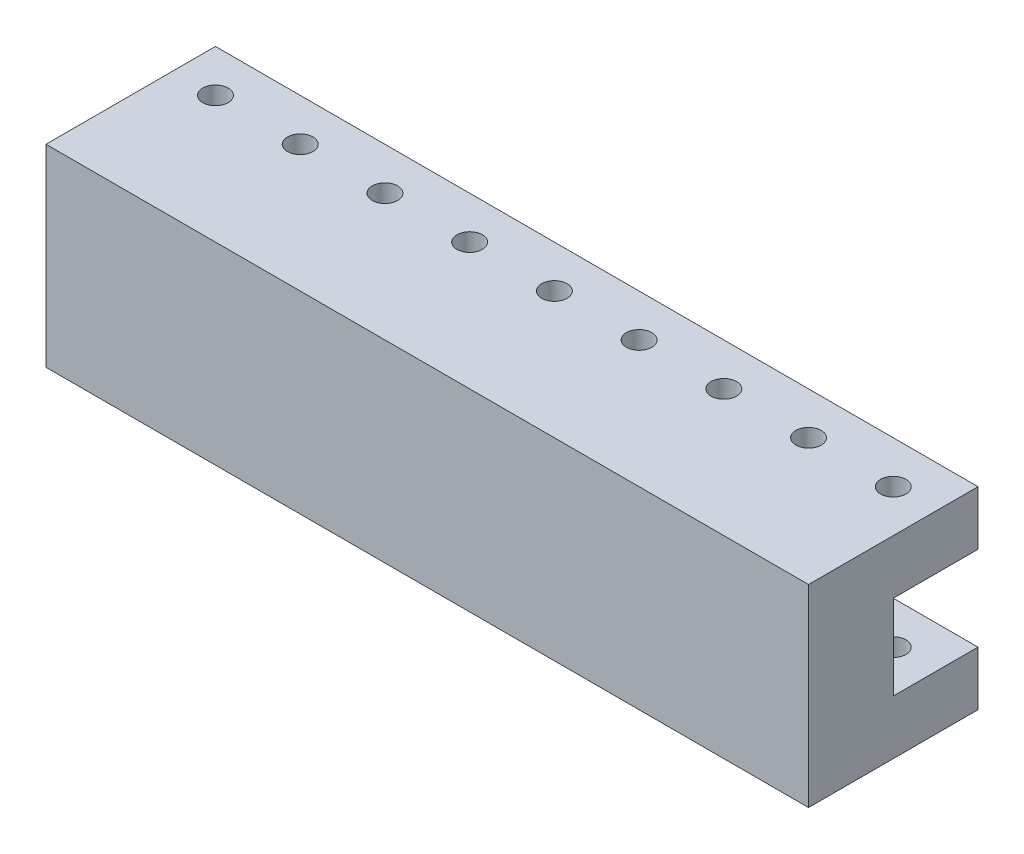
ISO-10303-21;
HEADER;
FILE_DESCRIPTION(('STEP AP214'),'2;1');
FILE_NAME('part.step','',(''),(''),'','','');
FILE_SCHEMA(('AUTOMOTIVE_DESIGN { 1 0 10303 214 1 1 1 1 }'));
ENDSEC;
DATA;
#1=APPLICATION_CONTEXT('core data for automotive mechanical design processes');
#2=APPLICATION_PROTOCOL_DEFINITION('international standard','automotive_design',2000,#1);
#3=PRODUCT_CONTEXT('',#1,'mechanical');
#4=PRODUCT('Part','Part','',(#3));
#5=PRODUCT_RELATED_PRODUCT_CATEGORY('part','',(#4));
#6=PRODUCT_DEFINITION_FORMATION('','',#4);
#7=PRODUCT_DEFINITION_CONTEXT('part definition',#1,'design');
#8=PRODUCT_DEFINITION('design','',#6,#7);
#9=PRODUCT_DEFINITION_SHAPE('','',#8);
#10=(LENGTH_UNIT() NAMED_UNIT(*) SI_UNIT(.MILLI.,.METRE.));
#11=(NAMED_UNIT(*) PLANE_ANGLE_UNIT() SI_UNIT($,.RADIAN.));
#12=(NAMED_UNIT(*) SI_UNIT($,.STERADIAN.) SOLID_ANGLE_UNIT());
#13=UNCERTAINTY_MEASURE_WITH_UNIT(LENGTH_MEASURE(1.E-05),#10,'distance_accuracy_value','');
#14=(GEOMETRIC_REPRESENTATION_CONTEXT(3) GLOBAL_UNCERTAINTY_ASSIGNED_CONTEXT((#13)) GLOBAL_UNIT_ASSIGNED_CONTEXT((#10,
#11,#12)) REPRESENTATION_CONTEXT('',''));
#15=CARTESIAN_POINT('',(0.,0.,0.));
#16=DIRECTION('',(0.,0.,1.));
#17=DIRECTION('',(1.,0.,0.));
#18=AXIS2_PLACEMENT_3D('',#15,#16,#17);
#19=CARTESIAN_POINT('',(0.,0.,5.));
#20=DIRECTION('',(0.,0.,-1.));
#21=DIRECTION('',(-1.,0.,0.));
#22=AXIS2_PLACEMENT_3D('',#19,#20,#21);
#23=PLANE('',#22);
#24=DIRECTION('',(0.,1.,0.));
#25=VECTOR('',#24,1.);
#26=CARTESIAN_POINT('',(45.,0.,5.));
#27=LINE('',#26,#25);
#28=CARTESIAN_POINT('',(45.,6.4,4.99999999999999));
#29=VERTEX_POINT('',#28);
#30=CARTESIAN_POINT('',(45.,16.4,5.));
#31=VERTEX_POINT('',#30);
#32=EDGE_CURVE('E169',#29,#31,#27,.T.);
#33=ORIENTED_EDGE('',*,*,#32,.F.);
#34=DIRECTION('',(1.,0.,0.));
#35=VECTOR('',#34,1.);
#36=CARTESIAN_POINT('',(-45.,6.4,4.99999999999999));
#37=LINE('',#36,#35);
#38=CARTESIAN_POINT('',(-45.,6.4,5.));
#39=VERTEX_POINT('',#38);
#40=EDGE_CURVE('E118',#39,#29,#37,.T.);
#41=ORIENTED_EDGE('',*,*,#40,.F.);
#42=DIRECTION('',(0.,-1.,0.));
#43=VECTOR('',#42,1.);
#44=CARTESIAN_POINT('',(-45.,0.,5.));
#45=LINE('',#44,#43);
#46=CARTESIAN_POINT('',(-45.,16.4,4.99999999999999));
#47=VERTEX_POINT('',#46);
#48=EDGE_CURVE('E129',#47,#39,#45,.T.);
#49=ORIENTED_EDGE('',*,*,#48,.F.);
#50=DIRECTION('',(1.,0.,0.));
#51=VECTOR('',#50,1.);
#52=CARTESIAN_POINT('',(-45.,16.4,4.99999999999999));
#53=LINE('',#52,#51);
#54=EDGE_CURVE('E71',#47,#31,#53,.T.);
#55=ORIENTED_EDGE('',*,*,#54,.T.);
#56=EDGE_LOOP('',(#33,#41,#49,#55));
#57=FACE_BOUND('',#56,.T.);
#58=ADVANCED_FACE('F37',(#57),#23,.T.);
#59=CARTESIAN_POINT('',(40.,0.,0.));
#60=DIRECTION('',(0.,1.,0.));
#61=DIRECTION('',(0.,0.,1.));
#62=AXIS2_PLACEMENT_3D('',#59,#60,#61);
#63=CYLINDRICAL_SURFACE('',#62,1.5);
#64=CARTESIAN_POINT('',(40.,16.4,0.));
#65=DIRECTION('',(0.,1.,0.));
#66=DIRECTION('',(0.,0.,1.));
#67=AXIS2_PLACEMENT_3D('',#64,#65,#66);
#68=CIRCLE('',#67,1.5);
#69=CARTESIAN_POINT('',(40.,16.4,1.49999999999999));
#70=VERTEX_POINT('',#69);
#71=EDGE_CURVE('E183',#70,#70,#68,.F.);
#72=ORIENTED_EDGE('',*,*,#71,.T.);
#73=EDGE_LOOP('',(#72));
#74=FACE_BOUND('',#73,.T.);
#75=CARTESIAN_POINT('',(40.,22.8,0.));
#76=DIRECTION('',(0.,1.,0.));
#77=DIRECTION('',(0.,0.,1.));
#78=AXIS2_PLACEMENT_3D('',#75,#76,#77);
#79=CIRCLE('',#78,1.5);
#80=CARTESIAN_POINT('',(40.,22.8,1.49999999999999));
#81=VERTEX_POINT('',#80);
#82=EDGE_CURVE('E189',#81,#81,#79,.T.);
#83=ORIENTED_EDGE('',*,*,#82,.T.);
#84=EDGE_LOOP('',(#83));
#85=FACE_BOUND('',#84,.T.);
#86=ADVANCED_FACE('F305',(#74,#85),#63,.F.);
#87=CARTESIAN_POINT('',(30.,0.,0.));
#88=DIRECTION('',(0.,1.,0.));
#89=DIRECTION('',(0.,0.,1.));
#90=AXIS2_PLACEMENT_3D('',#87,#88,#89);
#91=CYLINDRICAL_SURFACE('',#90,1.5);
#92=CARTESIAN_POINT('',(30.,16.4,0.));
#93=DIRECTION('',(0.,1.,0.));
#94=DIRECTION('',(0.,0.,1.));
#95=AXIS2_PLACEMENT_3D('',#92,#93,#94);
#96=CIRCLE('',#95,1.5);
#97=CARTESIAN_POINT('',(30.,16.4,1.5));
#98=VERTEX_POINT('',#97);
#99=EDGE_CURVE('E192',#98,#98,#96,.F.);
#100=ORIENTED_EDGE('',*,*,#99,.T.);
#101=EDGE_LOOP('',(#100));
#102=FACE_BOUND('',#101,.T.);
#103=CARTESIAN_POINT('',(30.,22.8,0.));
#104=DIRECTION('',(0.,1.,0.));
#105=DIRECTION('',(0.,0.,1.));
#106=AXIS2_PLACEMENT_3D('',#103,#104,#105);
#107=CIRCLE('',#106,1.5);
#108=CARTESIAN_POINT('',(30.,22.8,1.5));
#109=VERTEX_POINT('',#108);
#110=EDGE_CURVE('E193',#109,#109,#107,.T.);
#111=ORIENTED_EDGE('',*,*,#110,.T.);
#112=EDGE_LOOP('',(#111));
#113=FACE_BOUND('',#112,.T.);
#114=ADVANCED_FACE('F310',(#102,#113),#91,.F.);
#115=CARTESIAN_POINT('',(20.,0.,0.));
#116=DIRECTION('',(0.,1.,0.));
#117=DIRECTION('',(0.,0.,1.));
#118=AXIS2_PLACEMENT_3D('',#115,#116,#117);
#119=CYLINDRICAL_SURFACE('',#118,1.5);
#120=CARTESIAN_POINT('',(20.,16.4,0.));
#121=DIRECTION('',(0.,1.,0.));
#122=DIRECTION('',(0.,0.,1.));
#123=AXIS2_PLACEMENT_3D('',#120,#121,#122);
#124=CIRCLE('',#123,1.5);
#125=CARTESIAN_POINT('',(20.,16.4,1.5));
#126=VERTEX_POINT('',#125);
#127=EDGE_CURVE('E196',#126,#126,#124,.F.);
#128=ORIENTED_EDGE('',*,*,#127,.T.);
#129=EDGE_LOOP('',(#128));
#130=FACE_BOUND('',#129,.T.);
#131=CARTESIAN_POINT('',(20.,22.8,0.));
#132=DIRECTION('',(0.,1.,0.));
#133=DIRECTION('',(0.,0.,1.));
#134=AXIS2_PLACEMENT_3D('',#131,#132,#133);
#135=CIRCLE('',#134,1.5);
#136=CARTESIAN_POINT('',(20.,22.8,1.5));
#137=VERTEX_POINT('',#136);
#138=EDGE_CURVE('E197',#137,#137,#135,.T.);
#139=ORIENTED_EDGE('',*,*,#138,.T.);
#140=EDGE_LOOP('',(#139));
#141=FACE_BOUND('',#140,.T.);
#142=ADVANCED_FACE('F329',(#130,#141),#119,.F.);
#143=CARTESIAN_POINT('',(10.,0.,0.));
#144=DIRECTION('',(0.,1.,0.));
#145=DIRECTION('',(0.,0.,1.));
#146=AXIS2_PLACEMENT_3D('',#143,#144,#145);
#147=CYLINDRICAL_SURFACE('',#146,1.5);
#148=CARTESIAN_POINT('',(10.,16.4,0.));
#149=DIRECTION('',(0.,1.,0.));
#150=DIRECTION('',(0.,0.,1.));
#151=AXIS2_PLACEMENT_3D('',#148,#149,#150);
#152=CIRCLE('',#151,1.5);
#153=CARTESIAN_POINT('',(10.,16.4,1.5));
#154=VERTEX_POINT('',#153);
#155=EDGE_CURVE('E200',#154,#154,#152,.F.);
#156=ORIENTED_EDGE('',*,*,#155,.T.);
#157=EDGE_LOOP('',(#156));
#158=FACE_BOUND('',#157,.T.);
#159=CARTESIAN_POINT('',(10.,22.8,0.));
#160=DIRECTION('',(0.,1.,0.));
#161=DIRECTION('',(0.,0.,1.));
#162=AXIS2_PLACEMENT_3D('',#159,#160,#161);
#163=CIRCLE('',#162,1.5);
#164=CARTESIAN_POINT('',(10.,22.8,1.5));
#165=VERTEX_POINT('',#164);
#166=EDGE_CURVE('E201',#165,#165,#163,.T.);
#167=ORIENTED_EDGE('',*,*,#166,.T.);
#168=EDGE_LOOP('',(#167));
#169=FACE_BOUND('',#168,.T.);
#170=ADVANCED_FACE('F333',(#158,#169),#147,.F.);
#171=CARTESIAN_POINT('',(0.,0.,0.));
#172=DIRECTION('',(0.,1.,0.));
#173=DIRECTION('',(0.,0.,1.));
#174=AXIS2_PLACEMENT_3D('',#171,#172,#173);
#175=CYLINDRICAL_SURFACE('',#174,1.5);
#176=CARTESIAN_POINT('',(0.,16.4,0.));
#177=DIRECTION('',(0.,1.,0.));
#178=DIRECTION('',(0.,0.,1.));
#179=AXIS2_PLACEMENT_3D('',#176,#177,#178);
#180=CIRCLE('',#179,1.5);
#181=CARTESIAN_POINT('',(0.,16.4,1.5));
#182=VERTEX_POINT('',#181);
#183=EDGE_CURVE('E204',#182,#182,#180,.F.);
#184=ORIENTED_EDGE('',*,*,#183,.T.);
#185=EDGE_LOOP('',(#184));
#186=FACE_BOUND('',#185,.T.);
#187=CARTESIAN_POINT('',(0.,22.8,0.));
#188=DIRECTION('',(0.,1.,0.));
#189=DIRECTION('',(0.,0.,1.));
#190=AXIS2_PLACEMENT_3D('',#187,#188,#189);
#191=CIRCLE('',#190,1.5);
#192=CARTESIAN_POINT('',(0.,22.8,1.5));
#193=VERTEX_POINT('',#192);
#194=EDGE_CURVE('E205',#193,#193,#191,.T.);
#195=ORIENTED_EDGE('',*,*,#194,.T.);
#196=EDGE_LOOP('',(#195));
#197=FACE_BOUND('',#196,.T.);
#198=ADVANCED_FACE('F337',(#186,#197),#175,.F.);
#199=CARTESIAN_POINT('',(-10.,0.,0.));
#200=DIRECTION('',(0.,1.,0.));
#201=DIRECTION('',(0.,0.,1.));
#202=AXIS2_PLACEMENT_3D('',#199,#200,#201);
#203=CYLINDRICAL_SURFACE('',#202,1.5);
#204=CARTESIAN_POINT('',(-10.,16.4,0.));
#205=DIRECTION('',(0.,1.,0.));
#206=DIRECTION('',(0.,0.,1.));
#207=AXIS2_PLACEMENT_3D('',#204,#205,#206);
#208=CIRCLE('',#207,1.5);
#209=CARTESIAN_POINT('',(-10.,16.4,1.5));
#210=VERTEX_POINT('',#209);
#211=EDGE_CURVE('E208',#210,#210,#208,.F.);
#212=ORIENTED_EDGE('',*,*,#211,.T.);
#213=EDGE_LOOP('',(#212));
#214=FACE_BOUND('',#213,.T.);
#215=CARTESIAN_POINT('',(-10.,22.8,0.));
#216=DIRECTION('',(0.,1.,0.));
#217=DIRECTION('',(0.,0.,1.));
#218=AXIS2_PLACEMENT_3D('',#215,#216,#217);
#219=CIRCLE('',#218,1.5);
#220=CARTESIAN_POINT('',(-10.,22.8,1.5));
#221=VERTEX_POINT('',#220);
#222=EDGE_CURVE('E209',#221,#221,#219,.T.);
#223=ORIENTED_EDGE('',*,*,#222,.T.);
#224=EDGE_LOOP('',(#223));
#225=FACE_BOUND('',#224,.T.);
#226=ADVANCED_FACE('F341',(#214,#225),#203,.F.);
#227=CARTESIAN_POINT('',(-20.,0.,0.));
#228=DIRECTION('',(0.,1.,0.));
#229=DIRECTION('',(0.,0.,1.));
#230=AXIS2_PLACEMENT_3D('',#227,#228,#229);
#231=CYLINDRICAL_SURFACE('',#230,1.5);
#232=CARTESIAN_POINT('',(-20.,16.4,0.));
#233=DIRECTION('',(0.,1.,0.));
#234=DIRECTION('',(0.,0.,1.));
#235=AXIS2_PLACEMENT_3D('',#232,#233,#234);
#236=CIRCLE('',#235,1.5);
#237=CARTESIAN_POINT('',(-20.,16.4,1.5));
#238=VERTEX_POINT('',#237);
#239=EDGE_CURVE('E212',#238,#238,#236,.F.);
#240=ORIENTED_EDGE('',*,*,#239,.T.);
#241=EDGE_LOOP('',(#240));
#242=FACE_BOUND('',#241,.T.);
#243=CARTESIAN_POINT('',(-20.,22.8,0.));
#244=DIRECTION('',(0.,1.,0.));
#245=DIRECTION('',(0.,0.,1.));
#246=AXIS2_PLACEMENT_3D('',#243,#244,#245);
#247=CIRCLE('',#246,1.5);
#248=CARTESIAN_POINT('',(-20.,22.8,1.5));
#249=VERTEX_POINT('',#248);
#250=EDGE_CURVE('E213',#249,#249,#247,.T.);
#251=ORIENTED_EDGE('',*,*,#250,.T.);
#252=EDGE_LOOP('',(#251));
#253=FACE_BOUND('',#252,.T.);
#254=ADVANCED_FACE('F345',(#242,#253),#231,.F.);
#255=CARTESIAN_POINT('',(-45.,22.8,5.));
#256=DIRECTION('',(1.,0.,0.));
#257=DIRECTION('',(0.,0.,-1.));
#258=AXIS2_PLACEMENT_3D('',#255,#256,#257);
#259=PLANE('',#258);
#260=DIRECTION('',(0.,-1.,0.));
#261=VECTOR('',#260,1.);
#262=CARTESIAN_POINT('',(-45.,22.8,-5.));
#263=LINE('',#262,#261);
#264=CARTESIAN_POINT('',(-45.,22.8,-5.));
#265=VERTEX_POINT('',#264);
#266=CARTESIAN_POINT('',(-45.,16.4,-5.));
#267=VERTEX_POINT('',#266);
#268=EDGE_CURVE('E41',#265,#267,#263,.T.);
#269=ORIENTED_EDGE('',*,*,#268,.T.);
#270=DIRECTION('',(0.,0.,1.));
#271=VECTOR('',#270,1.);
#272=CARTESIAN_POINT('',(-45.,16.4,4.99999999999999));
#273=LINE('',#272,#271);
#274=EDGE_CURVE('E244',#267,#47,#273,.T.);
#275=ORIENTED_EDGE('',*,*,#274,.T.);
#276=ORIENTED_EDGE('',*,*,#48,.T.);
#277=DIRECTION('',(0.,0.,-1.));
#278=VECTOR('',#277,1.);
#279=CARTESIAN_POINT('',(-45.,6.4,4.99999999999999));
#280=LINE('',#279,#278);
#281=CARTESIAN_POINT('',(-45.,6.4,-5.00000000000012));
#282=VERTEX_POINT('',#281);
#283=EDGE_CURVE('E54',#39,#282,#280,.T.);
#284=ORIENTED_EDGE('',*,*,#283,.T.);
#285=DIRECTION('',(0.,-1.,0.));
#286=VECTOR('',#285,1.);
#287=CARTESIAN_POINT('',(-45.,22.8,-5.));
#288=LINE('',#287,#286);
#289=CARTESIAN_POINT('',(-45.,0.,-5.));
#290=VERTEX_POINT('',#289);
#291=EDGE_CURVE('E126',#282,#290,#288,.T.);
#292=ORIENTED_EDGE('',*,*,#291,.T.);
#293=DIRECTION('',(0.,0.,-1.));
#294=VECTOR('',#293,1.);
#295=CARTESIAN_POINT('',(-45.,0.,15.));
#296=LINE('',#295,#294);
#297=CARTESIAN_POINT('',(-45.,0.,15.));
#298=VERTEX_POINT('',#297);
#299=EDGE_CURVE('E181',#298,#290,#296,.T.);
#300=ORIENTED_EDGE('',*,*,#299,.F.);
#301=DIRECTION('',(0.,-1.,0.));
#302=VECTOR('',#301,1.);
#303=CARTESIAN_POINT('',(-45.,0.,15.));
#304=LINE('',#303,#302);
#305=CARTESIAN_POINT('',(-45.,22.8,15.));
#306=VERTEX_POINT('',#305);
#307=EDGE_CURVE('E165',#306,#298,#304,.T.);
#308=ORIENTED_EDGE('',*,*,#307,.F.);
#309=DIRECTION('',(0.,0.,1.));
#310=VECTOR('',#309,1.);
#311=CARTESIAN_POINT('',(-45.,22.8,5.));
#312=LINE('',#311,#310);
#313=EDGE_CURVE('E219',#265,#306,#312,.T.);
#314=ORIENTED_EDGE('',*,*,#313,.F.);
#315=EDGE_LOOP('',(#269,#275,#276,#284,#292,#300,#308,#314));
#316=FACE_BOUND('',#315,.T.);
#317=ADVANCED_FACE('F124',(#316),#259,.F.);
#318=CARTESIAN_POINT('',(45.,22.8,4.99999999999999));
#319=DIRECTION('',(-1.,0.,0.));
#320=DIRECTION('',(0.,0.,1.));
#321=AXIS2_PLACEMENT_3D('',#318,#319,#320);
#322=PLANE('',#321);
#323=DIRECTION('',(0.,0.,-1.));
#324=VECTOR('',#323,1.);
#325=CARTESIAN_POINT('',(45.,22.8,4.99999999999999));
#326=LINE('',#325,#324);
#327=CARTESIAN_POINT('',(45.,22.8,15.));
#328=VERTEX_POINT('',#327);
#329=CARTESIAN_POINT('',(45.,22.8,-5.00000000000001));
#330=VERTEX_POINT('',#329);
#331=EDGE_CURVE('E217',#328,#330,#326,.T.);
#332=ORIENTED_EDGE('',*,*,#331,.F.);
#333=DIRECTION('',(0.,1.,0.));
#334=VECTOR('',#333,1.);
#335=CARTESIAN_POINT('',(45.,0.,15.));
#336=LINE('',#335,#334);
#337=CARTESIAN_POINT('',(45.,0.,15.));
#338=VERTEX_POINT('',#337);
#339=EDGE_CURVE('E171',#338,#328,#336,.T.);
#340=ORIENTED_EDGE('',*,*,#339,.F.);
#341=DIRECTION('',(0.,0.,-1.));
#342=VECTOR('',#341,1.);
#343=CARTESIAN_POINT('',(45.,0.,15.));
#344=LINE('',#343,#342);
#345=CARTESIAN_POINT('',(45.,0.,-5.00000000000001));
#346=VERTEX_POINT('',#345);
#347=EDGE_CURVE('E177',#338,#346,#344,.T.);
#348=ORIENTED_EDGE('',*,*,#347,.T.);
#349=DIRECTION('',(0.,-1.,0.));
#350=VECTOR('',#349,1.);
#351=CARTESIAN_POINT('',(45.,22.8,-5.00000000000001));
#352=LINE('',#351,#350);
#353=CARTESIAN_POINT('',(45.,6.4,-5.00000000000001));
#354=VERTEX_POINT('',#353);
#355=EDGE_CURVE('E134',#354,#346,#352,.T.);
#356=ORIENTED_EDGE('',*,*,#355,.F.);
#357=DIRECTION('',(0.,0.,-1.));
#358=VECTOR('',#357,1.);
#359=CARTESIAN_POINT('',(45.,6.4,4.99999999999999));
#360=LINE('',#359,#358);
#361=EDGE_CURVE('E112',#29,#354,#360,.T.);
#362=ORIENTED_EDGE('',*,*,#361,.F.);
#363=ORIENTED_EDGE('',*,*,#32,.T.);
#364=DIRECTION('',(0.,0.,1.));
#365=VECTOR('',#364,1.);
#366=CARTESIAN_POINT('',(45.,16.4,4.99999999999999));
#367=LINE('',#366,#365);
#368=CARTESIAN_POINT('',(45.,16.4,-5.00000000000012));
#369=VERTEX_POINT('',#368);
#370=EDGE_CURVE('E46',#369,#31,#367,.T.);
#371=ORIENTED_EDGE('',*,*,#370,.F.);
#372=DIRECTION('',(0.,-1.,0.));
#373=VECTOR('',#372,1.);
#374=CARTESIAN_POINT('',(45.,22.8,-5.00000000000001));
#375=LINE('',#374,#373);
#376=EDGE_CURVE('E241',#330,#369,#375,.T.);
#377=ORIENTED_EDGE('',*,*,#376,.F.);
#378=EDGE_LOOP('',(#332,#340,#348,#356,#362,#363,#371,#377));
#379=FACE_BOUND('',#378,.T.);
#380=ADVANCED_FACE('F251',(#379),#322,.F.);
#381=CARTESIAN_POINT('',(45.,22.8,-5.00000000000001));
#382=DIRECTION('',(0.,0.,1.));
#383=DIRECTION('',(1.,0.,0.));
#384=AXIS2_PLACEMENT_3D('',#381,#382,#383);
#385=PLANE('',#384);
#386=ORIENTED_EDGE('',*,*,#376,.T.);
#387=DIRECTION('',(1.,0.,0.));
#388=VECTOR('',#387,1.);
#389=CARTESIAN_POINT('',(-45.,16.4,-5.00000000000012));
#390=LINE('',#389,#388);
#391=EDGE_CURVE('E11',#267,#369,#390,.T.);
#392=ORIENTED_EDGE('',*,*,#391,.F.);
#393=ORIENTED_EDGE('',*,*,#268,.F.);
#394=DIRECTION('',(-1.,0.,0.));
#395=VECTOR('',#394,1.);
#396=CARTESIAN_POINT('',(45.,22.8,-5.00000000000001));
#397=LINE('',#396,#395);
#398=EDGE_CURVE('E78',#330,#265,#397,.T.);
#399=ORIENTED_EDGE('',*,*,#398,.F.);
#400=EDGE_LOOP('',(#386,#392,#393,#399));
#401=FACE_BOUND('',#400,.T.);
#402=ADVANCED_FACE('F249',(#401),#385,.F.);
#403=CARTESIAN_POINT('',(-40.,0.,0.));
#404=DIRECTION('',(0.,1.,0.));
#405=DIRECTION('',(0.,0.,1.));
#406=AXIS2_PLACEMENT_3D('',#403,#404,#405);
#407=CYLINDRICAL_SURFACE('',#406,1.5);
#408=CARTESIAN_POINT('',(-40.,16.4,0.));
#409=DIRECTION('',(0.,1.,0.));
#410=DIRECTION('',(0.,0.,1.));
#411=AXIS2_PLACEMENT_3D('',#408,#409,#410);
#412=CIRCLE('',#411,1.5);
#413=CARTESIAN_POINT('',(-40.,16.4,1.5));
#414=VERTEX_POINT('',#413);
#415=EDGE_CURVE('E223',#414,#414,#412,.F.);
#416=ORIENTED_EDGE('',*,*,#415,.T.);
#417=EDGE_LOOP('',(#416));
#418=FACE_BOUND('',#417,.T.);
#419=CARTESIAN_POINT('',(-40.,22.8,0.));
#420=DIRECTION('',(0.,1.,0.));
#421=DIRECTION('',(0.,0.,1.));
#422=AXIS2_PLACEMENT_3D('',#419,#420,#421);
#423=CIRCLE('',#422,1.5);
#424=CARTESIAN_POINT('',(-40.,22.8,1.5));
#425=VERTEX_POINT('',#424);
#426=EDGE_CURVE('E188',#425,#425,#423,.T.);
#427=ORIENTED_EDGE('',*,*,#426,.T.);
#428=EDGE_LOOP('',(#427));
#429=FACE_BOUND('',#428,.T.);
#430=ADVANCED_FACE('F352',(#418,#429),#407,.F.);
#431=CARTESIAN_POINT('',(-30.,0.,0.));
#432=DIRECTION('',(0.,1.,0.));
#433=DIRECTION('',(0.,0.,1.));
#434=AXIS2_PLACEMENT_3D('',#431,#432,#433);
#435=CYLINDRICAL_SURFACE('',#434,1.5);
#436=CARTESIAN_POINT('',(-30.,16.4,0.));
#437=DIRECTION('',(0.,1.,0.));
#438=DIRECTION('',(0.,0.,1.));
#439=AXIS2_PLACEMENT_3D('',#436,#437,#438);
#440=CIRCLE('',#439,1.5);
#441=CARTESIAN_POINT('',(-30.,16.4,1.5));
#442=VERTEX_POINT('',#441);
#443=EDGE_CURVE('E184',#442,#442,#440,.F.);
#444=ORIENTED_EDGE('',*,*,#443,.T.);
#445=EDGE_LOOP('',(#444));
#446=FACE_BOUND('',#445,.T.);
#447=CARTESIAN_POINT('',(-30.,22.8,0.));
#448=DIRECTION('',(0.,1.,0.));
#449=DIRECTION('',(0.,0.,1.));
#450=AXIS2_PLACEMENT_3D('',#447,#448,#449);
#451=CIRCLE('',#450,1.5);
#452=CARTESIAN_POINT('',(-30.,22.8,1.5));
#453=VERTEX_POINT('',#452);
#454=EDGE_CURVE('E187',#453,#453,#451,.T.);
#455=ORIENTED_EDGE('',*,*,#454,.T.);
#456=EDGE_LOOP('',(#455));
#457=FACE_BOUND('',#456,.T.);
#458=ADVANCED_FACE('F39',(#446,#457),#435,.F.);
#459=CARTESIAN_POINT('',(0.,22.8,0.));
#460=DIRECTION('',(0.,1.,0.));
#461=DIRECTION('',(0.,0.,1.));
#462=AXIS2_PLACEMENT_3D('',#459,#460,#461);
#463=PLANE('',#462);
#464=ORIENTED_EDGE('',*,*,#454,.F.);
#465=EDGE_LOOP('',(#464));
#466=FACE_BOUND('',#465,.T.);
#467=ORIENTED_EDGE('',*,*,#426,.F.);
#468=EDGE_LOOP('',(#467));
#469=FACE_BOUND('',#468,.T.);
#470=ORIENTED_EDGE('',*,*,#313,.T.);
#471=DIRECTION('',(-1.,0.,0.));
#472=VECTOR('',#471,1.);
#473=CARTESIAN_POINT('',(-45.,22.8,15.));
#474=LINE('',#473,#472);
#475=EDGE_CURVE('E174',#328,#306,#474,.T.);
#476=ORIENTED_EDGE('',*,*,#475,.F.);
#477=ORIENTED_EDGE('',*,*,#331,.T.);
#478=ORIENTED_EDGE('',*,*,#398,.T.);
#479=EDGE_LOOP('',(#470,#476,#477,#478));
#480=FACE_BOUND('',#479,.T.);
#481=ORIENTED_EDGE('',*,*,#250,.F.);
#482=EDGE_LOOP('',(#481));
#483=FACE_BOUND('',#482,.T.);
#484=ORIENTED_EDGE('',*,*,#222,.F.);
#485=EDGE_LOOP('',(#484));
#486=FACE_BOUND('',#485,.T.);
#487=ORIENTED_EDGE('',*,*,#194,.F.);
#488=EDGE_LOOP('',(#487));
#489=FACE_BOUND('',#488,.T.);
#490=ORIENTED_EDGE('',*,*,#166,.F.);
#491=EDGE_LOOP('',(#490));
#492=FACE_BOUND('',#491,.T.);
#493=ORIENTED_EDGE('',*,*,#138,.F.);
#494=EDGE_LOOP('',(#493));
#495=FACE_BOUND('',#494,.T.);
#496=ORIENTED_EDGE('',*,*,#110,.F.);
#497=EDGE_LOOP('',(#496));
#498=FACE_BOUND('',#497,.T.);
#499=ORIENTED_EDGE('',*,*,#82,.F.);
#500=EDGE_LOOP('',(#499));
#501=FACE_BOUND('',#500,.T.);
#502=ADVANCED_FACE('F320',(#466,#469,#480,#483,#486,#489,#492,#495,#498,#501),#463,.T.);
#503=CARTESIAN_POINT('',(-45.,16.4,4.99999999999999));
#504=DIRECTION('',(0.,1.,0.));
#505=DIRECTION('',(0.,0.,1.));
#506=AXIS2_PLACEMENT_3D('',#503,#504,#505);
#507=PLANE('',#506);
#508=ORIENTED_EDGE('',*,*,#99,.F.);
#509=EDGE_LOOP('',(#508));
#510=FACE_BOUND('',#509,.T.);
#511=ORIENTED_EDGE('',*,*,#155,.F.);
#512=EDGE_LOOP('',(#511));
#513=FACE_BOUND('',#512,.T.);
#514=ORIENTED_EDGE('',*,*,#211,.F.);
#515=EDGE_LOOP('',(#514));
#516=FACE_BOUND('',#515,.T.);
#517=ORIENTED_EDGE('',*,*,#415,.F.);
#518=EDGE_LOOP('',(#517));
#519=FACE_BOUND('',#518,.T.);
#520=ORIENTED_EDGE('',*,*,#370,.T.);
#521=ORIENTED_EDGE('',*,*,#54,.F.);
#522=ORIENTED_EDGE('',*,*,#274,.F.);
#523=ORIENTED_EDGE('',*,*,#391,.T.);
#524=EDGE_LOOP('',(#520,#521,#522,#523));
#525=FACE_BOUND('',#524,.T.);
#526=ORIENTED_EDGE('',*,*,#443,.F.);
#527=EDGE_LOOP('',(#526));
#528=FACE_BOUND('',#527,.T.);
#529=ORIENTED_EDGE('',*,*,#239,.F.);
#530=EDGE_LOOP('',(#529));
#531=FACE_BOUND('',#530,.T.);
#532=ORIENTED_EDGE('',*,*,#183,.F.);
#533=EDGE_LOOP('',(#532));
#534=FACE_BOUND('',#533,.T.);
#535=ORIENTED_EDGE('',*,*,#127,.F.);
#536=EDGE_LOOP('',(#535));
#537=FACE_BOUND('',#536,.T.);
#538=ORIENTED_EDGE('',*,*,#71,.F.);
#539=EDGE_LOOP('',(#538));
#540=FACE_BOUND('',#539,.T.);
#541=ADVANCED_FACE('F254',(#510,#513,#516,#519,#525,#528,#531,#534,#537,#540),#507,.F.);
#542=CARTESIAN_POINT('',(-45.,0.,15.));
#543=DIRECTION('',(0.,1.,0.));
#544=DIRECTION('',(0.,0.,1.));
#545=AXIS2_PLACEMENT_3D('',#542,#543,#544);
#546=PLANE('',#545);
#547=ORIENTED_EDGE('',*,*,#299,.T.);
#548=DIRECTION('',(-1.,0.,0.));
#549=VECTOR('',#548,1.);
#550=CARTESIAN_POINT('',(45.,0.,-5.00000000000001));
#551=LINE('',#550,#549);
#552=EDGE_CURVE('E133',#346,#290,#551,.T.);
#553=ORIENTED_EDGE('',*,*,#552,.F.);
#554=ORIENTED_EDGE('',*,*,#347,.F.);
#555=DIRECTION('',(1.,0.,0.));
#556=VECTOR('',#555,1.);
#557=CARTESIAN_POINT('',(-45.,0.,15.));
#558=LINE('',#557,#556);
#559=EDGE_CURVE('E168',#298,#338,#558,.T.);
#560=ORIENTED_EDGE('',*,*,#559,.F.);
#561=EDGE_LOOP('',(#547,#553,#554,#560));
#562=FACE_BOUND('',#561,.T.);
#563=CARTESIAN_POINT('',(-30.,0.,0.));
#564=DIRECTION('',(0.,1.,0.));
#565=DIRECTION('',(0.,0.,1.));
#566=AXIS2_PLACEMENT_3D('',#563,#564,#565);
#567=CIRCLE('',#566,1.5);
#568=CARTESIAN_POINT('',(-30.,0.,1.5));
#569=VERTEX_POINT('',#568);
#570=EDGE_CURVE('E283',#569,#569,#567,.T.);
#571=ORIENTED_EDGE('',*,*,#570,.T.);
#572=EDGE_LOOP('',(#571));
#573=FACE_BOUND('',#572,.T.);
#574=CARTESIAN_POINT('',(-40.,0.,0.));
#575=DIRECTION('',(0.,1.,0.));
#576=DIRECTION('',(0.,0.,1.));
#577=AXIS2_PLACEMENT_3D('',#574,#575,#576);
#578=CIRCLE('',#577,1.5);
#579=CARTESIAN_POINT('',(-40.,0.,1.5));
#580=VERTEX_POINT('',#579);
#581=EDGE_CURVE('E138',#580,#580,#578,.T.);
#582=ORIENTED_EDGE('',*,*,#581,.T.);
#583=EDGE_LOOP('',(#582));
#584=FACE_BOUND('',#583,.T.);
#585=CARTESIAN_POINT('',(-20.,0.,0.));
#586=DIRECTION('',(0.,1.,0.));
#587=DIRECTION('',(0.,0.,1.));
#588=AXIS2_PLACEMENT_3D('',#585,#586,#587);
#589=CIRCLE('',#588,1.5);
#590=CARTESIAN_POINT('',(-20.,0.,1.5));
#591=VERTEX_POINT('',#590);
#592=EDGE_CURVE('E136',#591,#591,#589,.T.);
#593=ORIENTED_EDGE('',*,*,#592,.T.);
#594=EDGE_LOOP('',(#593));
#595=FACE_BOUND('',#594,.T.);
#596=CARTESIAN_POINT('',(-10.,0.,0.));
#597=DIRECTION('',(0.,1.,0.));
#598=DIRECTION('',(0.,0.,1.));
#599=AXIS2_PLACEMENT_3D('',#596,#597,#598);
#600=CIRCLE('',#599,1.5);
#601=CARTESIAN_POINT('',(-10.,0.,1.5));
#602=VERTEX_POINT('',#601);
#603=EDGE_CURVE('E144',#602,#602,#600,.T.);
#604=ORIENTED_EDGE('',*,*,#603,.T.);
#605=EDGE_LOOP('',(#604));
#606=FACE_BOUND('',#605,.T.);
#607=CARTESIAN_POINT('',(0.,0.,0.));
#608=DIRECTION('',(0.,1.,0.));
#609=DIRECTION('',(0.,0.,1.));
#610=AXIS2_PLACEMENT_3D('',#607,#608,#609);
#611=CIRCLE('',#610,1.5);
#612=CARTESIAN_POINT('',(0.,0.,1.5));
#613=VERTEX_POINT('',#612);
#614=EDGE_CURVE('E147',#613,#613,#611,.T.);
#615=ORIENTED_EDGE('',*,*,#614,.T.);
#616=EDGE_LOOP('',(#615));
#617=FACE_BOUND('',#616,.T.);
#618=CARTESIAN_POINT('',(10.,0.,0.));
#619=DIRECTION('',(0.,1.,0.));
#620=DIRECTION('',(0.,0.,1.));
#621=AXIS2_PLACEMENT_3D('',#618,#619,#620);
#622=CIRCLE('',#621,1.5);
#623=CARTESIAN_POINT('',(10.,0.,1.5));
#624=VERTEX_POINT('',#623);
#625=EDGE_CURVE('E150',#624,#624,#622,.T.);
#626=ORIENTED_EDGE('',*,*,#625,.T.);
#627=EDGE_LOOP('',(#626));
#628=FACE_BOUND('',#627,.T.);
#629=CARTESIAN_POINT('',(20.,0.,0.));
#630=DIRECTION('',(0.,1.,0.));
#631=DIRECTION('',(0.,0.,1.));
#632=AXIS2_PLACEMENT_3D('',#629,#630,#631);
#633=CIRCLE('',#632,1.5);
#634=CARTESIAN_POINT('',(20.,0.,1.5));
#635=VERTEX_POINT('',#634);
#636=EDGE_CURVE('E153',#635,#635,#633,.T.);
#637=ORIENTED_EDGE('',*,*,#636,.T.);
#638=EDGE_LOOP('',(#637));
#639=FACE_BOUND('',#638,.T.);
#640=CARTESIAN_POINT('',(30.,0.,0.));
#641=DIRECTION('',(0.,1.,0.));
#642=DIRECTION('',(0.,0.,1.));
#643=AXIS2_PLACEMENT_3D('',#640,#641,#642);
#644=CIRCLE('',#643,1.5);
#645=CARTESIAN_POINT('',(30.,0.,1.5));
#646=VERTEX_POINT('',#645);
#647=EDGE_CURVE('E156',#646,#646,#644,.T.);
#648=ORIENTED_EDGE('',*,*,#647,.T.);
#649=EDGE_LOOP('',(#648));
#650=FACE_BOUND('',#649,.T.);
#651=CARTESIAN_POINT('',(40.,0.,0.));
#652=DIRECTION('',(0.,1.,0.));
#653=DIRECTION('',(0.,0.,1.));
#654=AXIS2_PLACEMENT_3D('',#651,#652,#653);
#655=CIRCLE('',#654,1.5);
#656=CARTESIAN_POINT('',(40.,0.,1.49999999999999));
#657=VERTEX_POINT('',#656);
#658=EDGE_CURVE('E159',#657,#657,#655,.T.);
#659=ORIENTED_EDGE('',*,*,#658,.T.);
#660=EDGE_LOOP('',(#659));
#661=FACE_BOUND('',#660,.T.);
#662=ADVANCED_FACE('F288',(#562,#573,#584,#595,#606,#617,#628,#639,#650,#661),#546,.F.);
#663=CARTESIAN_POINT('',(0.,0.,15.));
#664=DIRECTION('',(0.,0.,-1.));
#665=DIRECTION('',(-1.,0.,0.));
#666=AXIS2_PLACEMENT_3D('',#663,#664,#665);
#667=PLANE('',#666);
#668=ORIENTED_EDGE('',*,*,#307,.T.);
#669=ORIENTED_EDGE('',*,*,#559,.T.);
#670=ORIENTED_EDGE('',*,*,#339,.T.);
#671=ORIENTED_EDGE('',*,*,#475,.T.);
#672=EDGE_LOOP('',(#668,#669,#670,#671));
#673=FACE_BOUND('',#672,.T.);
#674=ADVANCED_FACE('F315',(#673),#667,.F.);
#675=CARTESIAN_POINT('',(40.,0.,0.));
#676=DIRECTION('',(0.,1.,0.));
#677=DIRECTION('',(0.,0.,1.));
#678=AXIS2_PLACEMENT_3D('',#675,#676,#677);
#679=CYLINDRICAL_SURFACE('',#678,1.5);
#680=CARTESIAN_POINT('',(40.,6.4,0.));
#681=DIRECTION('',(0.,-1.,0.));
#682=DIRECTION('',(0.,0.,-1.));
#683=AXIS2_PLACEMENT_3D('',#680,#681,#682);
#684=CIRCLE('',#683,1.5);
#685=CARTESIAN_POINT('',(40.,6.4,-1.50000000000001));
#686=VERTEX_POINT('',#685);
#687=EDGE_CURVE('E280',#686,#686,#684,.F.);
#688=ORIENTED_EDGE('',*,*,#687,.T.);
#689=EDGE_LOOP('',(#688));
#690=FACE_BOUND('',#689,.T.);
#691=ORIENTED_EDGE('',*,*,#658,.F.);
#692=EDGE_LOOP('',(#691));
#693=FACE_BOUND('',#692,.T.);
#694=ADVANCED_FACE('F396',(#690,#693),#679,.F.);
#695=CARTESIAN_POINT('',(30.,0.,0.));
#696=DIRECTION('',(0.,1.,0.));
#697=DIRECTION('',(0.,0.,1.));
#698=AXIS2_PLACEMENT_3D('',#695,#696,#697);
#699=CYLINDRICAL_SURFACE('',#698,1.5);
#700=CARTESIAN_POINT('',(30.,6.4,0.));
#701=DIRECTION('',(0.,-1.,0.));
#702=DIRECTION('',(0.,0.,-1.));
#703=AXIS2_PLACEMENT_3D('',#700,#701,#702);
#704=CIRCLE('',#703,1.5);
#705=CARTESIAN_POINT('',(30.,6.4,-1.50000000000001));
#706=VERTEX_POINT('',#705);
#707=EDGE_CURVE('E277',#706,#706,#704,.F.);
#708=ORIENTED_EDGE('',*,*,#707,.T.);
#709=EDGE_LOOP('',(#708));
#710=FACE_BOUND('',#709,.T.);
#711=ORIENTED_EDGE('',*,*,#647,.F.);
#712=EDGE_LOOP('',(#711));
#713=FACE_BOUND('',#712,.T.);
#714=ADVANCED_FACE('F400',(#710,#713),#699,.F.);
#715=CARTESIAN_POINT('',(20.,0.,0.));
#716=DIRECTION('',(0.,1.,0.));
#717=DIRECTION('',(0.,0.,1.));
#718=AXIS2_PLACEMENT_3D('',#715,#716,#717);
#719=CYLINDRICAL_SURFACE('',#718,1.5);
#720=CARTESIAN_POINT('',(20.,6.4,0.));
#721=DIRECTION('',(0.,-1.,0.));
#722=DIRECTION('',(0.,0.,-1.));
#723=AXIS2_PLACEMENT_3D('',#720,#721,#722);
#724=CIRCLE('',#723,1.5);
#725=CARTESIAN_POINT('',(20.,6.4,-1.50000000000001));
#726=VERTEX_POINT('',#725);
#727=EDGE_CURVE('E274',#726,#726,#724,.F.);
#728=ORIENTED_EDGE('',*,*,#727,.T.);
#729=EDGE_LOOP('',(#728));
#730=FACE_BOUND('',#729,.T.);
#731=ORIENTED_EDGE('',*,*,#636,.F.);
#732=EDGE_LOOP('',(#731));
#733=FACE_BOUND('',#732,.T.);
#734=ADVANCED_FACE('F405',(#730,#733),#719,.F.);
#735=CARTESIAN_POINT('',(10.,0.,0.));
#736=DIRECTION('',(0.,1.,0.));
#737=DIRECTION('',(0.,0.,1.));
#738=AXIS2_PLACEMENT_3D('',#735,#736,#737);
#739=CYLINDRICAL_SURFACE('',#738,1.5);
#740=CARTESIAN_POINT('',(10.,6.4,0.));
#741=DIRECTION('',(0.,-1.,0.));
#742=DIRECTION('',(0.,0.,-1.));
#743=AXIS2_PLACEMENT_3D('',#740,#741,#742);
#744=CIRCLE('',#743,1.5);
#745=CARTESIAN_POINT('',(10.,6.4,-1.50000000000001));
#746=VERTEX_POINT('',#745);
#747=EDGE_CURVE('E271',#746,#746,#744,.F.);
#748=ORIENTED_EDGE('',*,*,#747,.T.);
#749=EDGE_LOOP('',(#748));
#750=FACE_BOUND('',#749,.T.);
#751=ORIENTED_EDGE('',*,*,#625,.F.);
#752=EDGE_LOOP('',(#751));
#753=FACE_BOUND('',#752,.T.);
#754=ADVANCED_FACE('F412',(#750,#753),#739,.F.);
#755=CARTESIAN_POINT('',(0.,0.,0.));
#756=DIRECTION('',(0.,1.,0.));
#757=DIRECTION('',(0.,0.,1.));
#758=AXIS2_PLACEMENT_3D('',#755,#756,#757);
#759=CYLINDRICAL_SURFACE('',#758,1.5);
#760=CARTESIAN_POINT('',(0.,6.4,0.));
#761=DIRECTION('',(0.,-1.,0.));
#762=DIRECTION('',(0.,0.,-1.));
#763=AXIS2_PLACEMENT_3D('',#760,#761,#762);
#764=CIRCLE('',#763,1.5);
#765=CARTESIAN_POINT('',(0.,6.4,-1.50000000000001));
#766=VERTEX_POINT('',#765);
#767=EDGE_CURVE('E268',#766,#766,#764,.F.);
#768=ORIENTED_EDGE('',*,*,#767,.T.);
#769=EDGE_LOOP('',(#768));
#770=FACE_BOUND('',#769,.T.);
#771=ORIENTED_EDGE('',*,*,#614,.F.);
#772=EDGE_LOOP('',(#771));
#773=FACE_BOUND('',#772,.T.);
#774=ADVANCED_FACE('F416',(#770,#773),#759,.F.);
#775=CARTESIAN_POINT('',(-10.,0.,0.));
#776=DIRECTION('',(0.,1.,0.));
#777=DIRECTION('',(0.,0.,1.));
#778=AXIS2_PLACEMENT_3D('',#775,#776,#777);
#779=CYLINDRICAL_SURFACE('',#778,1.5);
#780=CARTESIAN_POINT('',(-10.,6.4,0.));
#781=DIRECTION('',(0.,-1.,0.));
#782=DIRECTION('',(0.,0.,-1.));
#783=AXIS2_PLACEMENT_3D('',#780,#781,#782);
#784=CIRCLE('',#783,1.5);
#785=CARTESIAN_POINT('',(-10.,6.4,-1.50000000000001));
#786=VERTEX_POINT('',#785);
#787=EDGE_CURVE('E265',#786,#786,#784,.F.);
#788=ORIENTED_EDGE('',*,*,#787,.T.);
#789=EDGE_LOOP('',(#788));
#790=FACE_BOUND('',#789,.T.);
#791=ORIENTED_EDGE('',*,*,#603,.F.);
#792=EDGE_LOOP('',(#791));
#793=FACE_BOUND('',#792,.T.);
#794=ADVANCED_FACE('F420',(#790,#793),#779,.F.);
#795=CARTESIAN_POINT('',(-20.,0.,0.));
#796=DIRECTION('',(0.,1.,0.));
#797=DIRECTION('',(0.,0.,1.));
#798=AXIS2_PLACEMENT_3D('',#795,#796,#797);
#799=CYLINDRICAL_SURFACE('',#798,1.5);
#800=CARTESIAN_POINT('',(-20.,6.4,0.));
#801=DIRECTION('',(0.,-1.,0.));
#802=DIRECTION('',(0.,0.,-1.));
#803=AXIS2_PLACEMENT_3D('',#800,#801,#802);
#804=CIRCLE('',#803,1.5);
#805=CARTESIAN_POINT('',(-20.,6.4,-1.50000000000001));
#806=VERTEX_POINT('',#805);
#807=EDGE_CURVE('E262',#806,#806,#804,.F.);
#808=ORIENTED_EDGE('',*,*,#807,.T.);
#809=EDGE_LOOP('',(#808));
#810=FACE_BOUND('',#809,.T.);
#811=ORIENTED_EDGE('',*,*,#592,.F.);
#812=EDGE_LOOP('',(#811));
#813=FACE_BOUND('',#812,.T.);
#814=ADVANCED_FACE('F302',(#810,#813),#799,.F.);
#815=CARTESIAN_POINT('',(45.,22.8,-5.00000000000001));
#816=DIRECTION('',(0.,0.,1.));
#817=DIRECTION('',(1.,0.,0.));
#818=AXIS2_PLACEMENT_3D('',#815,#816,#817);
#819=PLANE('',#818);
#820=ORIENTED_EDGE('',*,*,#291,.F.);
#821=DIRECTION('',(1.,0.,0.));
#822=VECTOR('',#821,1.);
#823=CARTESIAN_POINT('',(-45.,6.4,-5.00000000000012));
#824=LINE('',#823,#822);
#825=EDGE_CURVE('E108',#282,#354,#824,.T.);
#826=ORIENTED_EDGE('',*,*,#825,.T.);
#827=ORIENTED_EDGE('',*,*,#355,.T.);
#828=ORIENTED_EDGE('',*,*,#552,.T.);
#829=EDGE_LOOP('',(#820,#826,#827,#828));
#830=FACE_BOUND('',#829,.T.);
#831=ADVANCED_FACE('F131',(#830),#819,.F.);
#832=CARTESIAN_POINT('',(-40.,0.,0.));
#833=DIRECTION('',(0.,1.,0.));
#834=DIRECTION('',(0.,0.,1.));
#835=AXIS2_PLACEMENT_3D('',#832,#833,#834);
#836=CYLINDRICAL_SURFACE('',#835,1.5);
#837=CARTESIAN_POINT('',(-40.,6.4,0.));
#838=DIRECTION('',(0.,-1.,0.));
#839=DIRECTION('',(0.,0.,-1.));
#840=AXIS2_PLACEMENT_3D('',#837,#838,#839);
#841=CIRCLE('',#840,1.5);
#842=CARTESIAN_POINT('',(-40.,6.4,-1.5));
#843=VERTEX_POINT('',#842);
#844=EDGE_CURVE('E164',#843,#843,#841,.F.);
#845=ORIENTED_EDGE('',*,*,#844,.T.);
#846=EDGE_LOOP('',(#845));
#847=FACE_BOUND('',#846,.T.);
#848=ORIENTED_EDGE('',*,*,#581,.F.);
#849=EDGE_LOOP('',(#848));
#850=FACE_BOUND('',#849,.T.);
#851=ADVANCED_FACE('F291',(#847,#850),#836,.F.);
#852=CARTESIAN_POINT('',(-30.,0.,0.));
#853=DIRECTION('',(0.,1.,0.));
#854=DIRECTION('',(0.,0.,1.));
#855=AXIS2_PLACEMENT_3D('',#852,#853,#854);
#856=CYLINDRICAL_SURFACE('',#855,1.5);
#857=CARTESIAN_POINT('',(-30.,6.4,0.));
#858=DIRECTION('',(0.,-1.,0.));
#859=DIRECTION('',(0.,0.,-1.));
#860=AXIS2_PLACEMENT_3D('',#857,#858,#859);
#861=CIRCLE('',#860,1.5);
#862=CARTESIAN_POINT('',(-30.,6.4,-1.50000000000001));
#863=VERTEX_POINT('',#862);
#864=EDGE_CURVE('E117',#863,#863,#861,.F.);
#865=ORIENTED_EDGE('',*,*,#864,.T.);
#866=EDGE_LOOP('',(#865));
#867=FACE_BOUND('',#866,.T.);
#868=ORIENTED_EDGE('',*,*,#570,.F.);
#869=EDGE_LOOP('',(#868));
#870=FACE_BOUND('',#869,.T.);
#871=ADVANCED_FACE('F293',(#867,#870),#856,.F.);
#872=CARTESIAN_POINT('',(-45.,6.4,4.99999999999999));
#873=DIRECTION('',(0.,-1.,0.));
#874=DIRECTION('',(0.,0.,-1.));
#875=AXIS2_PLACEMENT_3D('',#872,#873,#874);
#876=PLANE('',#875);
#877=ORIENTED_EDGE('',*,*,#707,.F.);
#878=EDGE_LOOP('',(#877));
#879=FACE_BOUND('',#878,.T.);
#880=ORIENTED_EDGE('',*,*,#747,.F.);
#881=EDGE_LOOP('',(#880));
#882=FACE_BOUND('',#881,.T.);
#883=ORIENTED_EDGE('',*,*,#787,.F.);
#884=EDGE_LOOP('',(#883));
#885=FACE_BOUND('',#884,.T.);
#886=ORIENTED_EDGE('',*,*,#844,.F.);
#887=EDGE_LOOP('',(#886));
#888=FACE_BOUND('',#887,.T.);
#889=ORIENTED_EDGE('',*,*,#361,.T.);
#890=ORIENTED_EDGE('',*,*,#825,.F.);
#891=ORIENTED_EDGE('',*,*,#283,.F.);
#892=ORIENTED_EDGE('',*,*,#40,.T.);
#893=EDGE_LOOP('',(#889,#890,#891,#892));
#894=FACE_BOUND('',#893,.T.);
#895=ORIENTED_EDGE('',*,*,#864,.F.);
#896=EDGE_LOOP('',(#895));
#897=FACE_BOUND('',#896,.T.);
#898=ORIENTED_EDGE('',*,*,#807,.F.);
#899=EDGE_LOOP('',(#898));
#900=FACE_BOUND('',#899,.T.);
#901=ORIENTED_EDGE('',*,*,#767,.F.);
#902=EDGE_LOOP('',(#901));
#903=FACE_BOUND('',#902,.T.);
#904=ORIENTED_EDGE('',*,*,#727,.F.);
#905=EDGE_LOOP('',(#904));
#906=FACE_BOUND('',#905,.T.);
#907=ORIENTED_EDGE('',*,*,#687,.F.);
#908=EDGE_LOOP('',(#907));
#909=FACE_BOUND('',#908,.T.);
#910=ADVANCED_FACE('F109',(#879,#882,#885,#888,#894,#897,#900,#903,#906,#909),#876,.F.);
#911=CLOSED_SHELL('',(#58,#86,#114,#142,#170,#198,#226,#254,#317,#380,#402,#430,#458,#502,#541,
#662,#674,#694,#714,#734,#754,#774,#794,#814,#831,#851,#871,#910));
#912=MANIFOLD_SOLID_BREP('B2',#911);
#913=ADVANCED_BREP_SHAPE_REPRESENTATION('',(#18,#912),#14);
#914=SHAPE_DEFINITION_REPRESENTATION(#9,#913);
ENDSEC;
END-ISO-10303-21;
